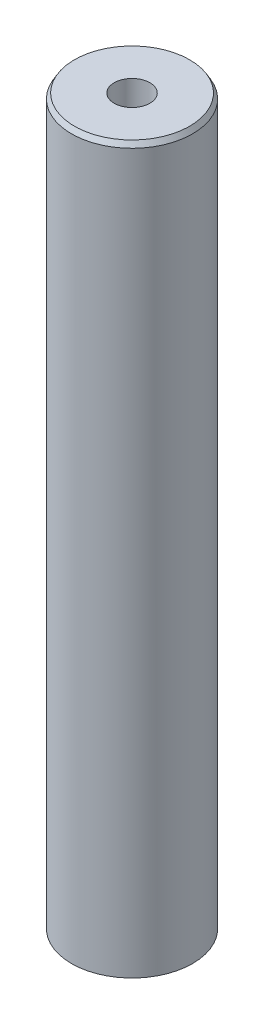
ISO-10303-21;
HEADER;
FILE_DESCRIPTION(('STEP AP214'),'2;1');
FILE_NAME('part.step','',(''),(''),'','','');
FILE_SCHEMA(('AUTOMOTIVE_DESIGN { 1 0 10303 214 1 1 1 1 }'));
ENDSEC;
DATA;
#1=APPLICATION_CONTEXT('core data for automotive mechanical design processes');
#2=APPLICATION_PROTOCOL_DEFINITION('international standard','automotive_design',2000,#1);
#3=PRODUCT_CONTEXT('',#1,'mechanical');
#4=PRODUCT('Part','Part','',(#3));
#5=PRODUCT_RELATED_PRODUCT_CATEGORY('part','',(#4));
#6=PRODUCT_DEFINITION_FORMATION('','',#4);
#7=PRODUCT_DEFINITION_CONTEXT('part definition',#1,'design');
#8=PRODUCT_DEFINITION('design','',#6,#7);
#9=PRODUCT_DEFINITION_SHAPE('','',#8);
#10=(LENGTH_UNIT() NAMED_UNIT(*) SI_UNIT(.MILLI.,.METRE.));
#11=(NAMED_UNIT(*) PLANE_ANGLE_UNIT() SI_UNIT($,.RADIAN.));
#12=(NAMED_UNIT(*) SI_UNIT($,.STERADIAN.) SOLID_ANGLE_UNIT());
#13=UNCERTAINTY_MEASURE_WITH_UNIT(LENGTH_MEASURE(1.E-05),#10,'distance_accuracy_value','');
#14=(GEOMETRIC_REPRESENTATION_CONTEXT(3) GLOBAL_UNCERTAINTY_ASSIGNED_CONTEXT((#13)) GLOBAL_UNIT_ASSIGNED_CONTEXT((#10,
#11,#12)) REPRESENTATION_CONTEXT('',''));
#15=CARTESIAN_POINT('',(0.,0.,0.));
#16=DIRECTION('',(0.,0.,1.));
#17=DIRECTION('',(1.,0.,0.));
#18=AXIS2_PLACEMENT_3D('',#15,#16,#17);
#19=CARTESIAN_POINT('',(0.,600.,0.));
#20=DIRECTION('',(0.,-1.,0.));
#21=DIRECTION('',(0.,0.,-1.));
#22=AXIS2_PLACEMENT_3D('',#19,#20,#21);
#23=CYLINDRICAL_SURFACE('',#22,50.);
#24=CARTESIAN_POINT('',(0.,595.781942175548,0.));
#25=DIRECTION('',(0.,1.,0.));
#26=DIRECTION('',(0.,0.,1.));
#27=AXIS2_PLACEMENT_3D('',#24,#25,#26);
#28=CIRCLE('',#27,50.);
#29=CARTESIAN_POINT('',(0.,595.781942175548,-50.));
#30=VERTEX_POINT('',#29);
#31=EDGE_CURVE('E50',#30,#30,#28,.F.);
#32=ORIENTED_EDGE('',*,*,#31,.T.);
#33=EDGE_LOOP('',(#32));
#34=FACE_BOUND('',#33,.T.);
#35=CARTESIAN_POINT('',(0.,2.43529682040466,0.));
#36=DIRECTION('',(0.,1.,0.));
#37=DIRECTION('',(0.,0.,1.));
#38=AXIS2_PLACEMENT_3D('',#35,#36,#37);
#39=CIRCLE('',#38,50.);
#40=CARTESIAN_POINT('',(0.,2.43529682040466,50.));
#41=VERTEX_POINT('',#40);
#42=EDGE_CURVE('E51',#41,#41,#39,.T.);
#43=ORIENTED_EDGE('',*,*,#42,.T.);
#44=EDGE_LOOP('',(#43));
#45=FACE_BOUND('',#44,.T.);
#46=ADVANCED_FACE('F39',(#34,#45),#23,.T.);
#47=CARTESIAN_POINT('',(0.,600.,0.));
#48=DIRECTION('',(0.,1.,0.));
#49=DIRECTION('',(0.,0.,1.));
#50=AXIS2_PLACEMENT_3D('',#47,#48,#49);
#51=PLANE('',#50);
#52=CARTESIAN_POINT('',(0.,600.,0.));
#53=DIRECTION('',(0.,1.,0.));
#54=DIRECTION('',(0.,0.,1.));
#55=AXIS2_PLACEMENT_3D('',#52,#53,#54);
#56=CIRCLE('',#55,47.5647031795954);
#57=CARTESIAN_POINT('',(0.,600.,-47.5647031795955));
#58=VERTEX_POINT('',#57);
#59=EDGE_CURVE('E54',#58,#58,#56,.T.);
#60=ORIENTED_EDGE('',*,*,#59,.T.);
#61=EDGE_LOOP('',(#60));
#62=FACE_BOUND('',#61,.T.);
#63=CARTESIAN_POINT('',(0.,600.,0.));
#64=DIRECTION('',(0.,1.,0.));
#65=DIRECTION('',(0.,0.,1.));
#66=AXIS2_PLACEMENT_3D('',#63,#64,#65);
#67=CIRCLE('',#66,14.729349144792);
#68=CARTESIAN_POINT('',(0.,600.,14.729349144792));
#69=VERTEX_POINT('',#68);
#70=EDGE_CURVE('E58',#69,#69,#67,.T.);
#71=ORIENTED_EDGE('',*,*,#70,.F.);
#72=EDGE_LOOP('',(#71));
#73=FACE_BOUND('',#72,.T.);
#74=ADVANCED_FACE('F69',(#62,#73),#51,.T.);
#75=CARTESIAN_POINT('',(0.,0.,0.));
#76=DIRECTION('',(0.,1.,0.));
#77=DIRECTION('',(0.,0.,1.));
#78=AXIS2_PLACEMENT_3D('',#75,#76,#77);
#79=PLANE('',#78);
#80=CARTESIAN_POINT('',(0.,0.,0.));
#81=DIRECTION('',(0.,1.,0.));
#82=DIRECTION('',(0.,0.,1.));
#83=AXIS2_PLACEMENT_3D('',#80,#81,#82);
#84=CIRCLE('',#83,45.7819421755482);
#85=CARTESIAN_POINT('',(0.,0.,45.7819421755482));
#86=VERTEX_POINT('',#85);
#87=EDGE_CURVE('E10',#86,#86,#84,.F.);
#88=ORIENTED_EDGE('',*,*,#87,.T.);
#89=EDGE_LOOP('',(#88));
#90=FACE_BOUND('',#89,.T.);
#91=CARTESIAN_POINT('',(0.,0.,0.));
#92=DIRECTION('',(0.,1.,0.));
#93=DIRECTION('',(0.,0.,1.));
#94=AXIS2_PLACEMENT_3D('',#91,#92,#93);
#95=CIRCLE('',#94,14.729349144792);
#96=CARTESIAN_POINT('',(0.,0.,14.729349144792));
#97=VERTEX_POINT('',#96);
#98=EDGE_CURVE('E63',#97,#97,#95,.T.);
#99=ORIENTED_EDGE('',*,*,#98,.T.);
#100=EDGE_LOOP('',(#99));
#101=FACE_BOUND('',#100,.T.);
#102=ADVANCED_FACE('F75',(#90,#101),#79,.F.);
#103=CARTESIAN_POINT('',(0.,600.,0.));
#104=DIRECTION('',(0.,-1.,0.));
#105=DIRECTION('',(0.,0.,-1.));
#106=AXIS2_PLACEMENT_3D('',#103,#104,#105);
#107=CYLINDRICAL_SURFACE('',#106,14.729349144792);
#108=ORIENTED_EDGE('',*,*,#70,.T.);
#109=EDGE_LOOP('',(#108));
#110=FACE_BOUND('',#109,.T.);
#111=ORIENTED_EDGE('',*,*,#98,.F.);
#112=EDGE_LOOP('',(#111));
#113=FACE_BOUND('',#112,.T.);
#114=ADVANCED_FACE('F70',(#110,#113),#107,.F.);
#115=CARTESIAN_POINT('',(0.,600.,0.));
#116=DIRECTION('',(0.,-1.,0.));
#117=DIRECTION('',(0.,0.,-1.));
#118=AXIS2_PLACEMENT_3D('',#115,#116,#117);
#119=CONICAL_SURFACE('',#118,47.5647031795954,0.523598775598302);
#120=CARTESIAN_POINT('',(0.,595.781942175548,-50.));
#121=CARTESIAN_POINT('',(0.,595.825880277886,-49.9746323247875));
#122=CARTESIAN_POINT('',(0.,595.869818380224,-49.9492646495749));
#123=CARTESIAN_POINT('',(0.,595.9576945849,-49.8985292991498));
#124=CARTESIAN_POINT('',(0.,596.001632687238,-49.8731616239373));
#125=CARTESIAN_POINT('',(0.,596.089508891915,-49.8224262735122));
#126=CARTESIAN_POINT('',(0.,596.133446994253,-49.7970585982997));
#127=CARTESIAN_POINT('',(0.,596.221323198929,-49.7463232478746));
#128=CARTESIAN_POINT('',(0.,596.265261301267,-49.720955572662));
#129=CARTESIAN_POINT('',(0.,596.353137505943,-49.6702202222369));
#130=CARTESIAN_POINT('',(0.,596.397075608281,-49.6448525470244));
#131=CARTESIAN_POINT('',(0.,596.484951812957,-49.5941171965993));
#132=CARTESIAN_POINT('',(0.,596.528889915295,-49.5687495213867));
#133=CARTESIAN_POINT('',(0.,596.616766119971,-49.5180141709616));
#134=CARTESIAN_POINT('',(0.,596.660704222309,-49.4926464957491));
#135=CARTESIAN_POINT('',(0.,596.748580426985,-49.441911145324));
#136=CARTESIAN_POINT('',(0.,596.792518529323,-49.4165434701114));
#137=CARTESIAN_POINT('',(0.,596.880394733999,-49.3658081196863));
#138=CARTESIAN_POINT('',(0.,596.924332836337,-49.3404404444738));
#139=CARTESIAN_POINT('',(0.,597.012209041013,-49.2897050940487));
#140=CARTESIAN_POINT('',(0.,597.056147143351,-49.2643374188362));
#141=CARTESIAN_POINT('',(0.,597.144023348028,-49.2136020684111));
#142=CARTESIAN_POINT('',(0.,597.187961450365,-49.1882343931985));
#143=CARTESIAN_POINT('',(0.,597.275837655042,-49.1374990427734));
#144=CARTESIAN_POINT('',(0.,597.31977575738,-49.1121313675609));
#145=CARTESIAN_POINT('',(0.,597.407651962056,-49.0613960171358));
#146=CARTESIAN_POINT('',(0.,597.451590064394,-49.0360283419232));
#147=CARTESIAN_POINT('',(0.,597.53946626907,-48.9852929914981));
#148=CARTESIAN_POINT('',(0.,597.583404371408,-48.9599253162856));
#149=CARTESIAN_POINT('',(0.,597.671280576084,-48.9091899658605));
#150=CARTESIAN_POINT('',(0.,597.715218678422,-48.8838222906479));
#151=CARTESIAN_POINT('',(0.,597.803094883098,-48.8330869402228));
#152=CARTESIAN_POINT('',(0.,597.847032985436,-48.8077192650103));
#153=CARTESIAN_POINT('',(0.,597.934909190112,-48.7569839145852));
#154=CARTESIAN_POINT('',(0.,597.97884729245,-48.7316162393727));
#155=CARTESIAN_POINT('',(0.,598.066723497126,-48.6808808889476));
#156=CARTESIAN_POINT('',(0.,598.110661599464,-48.655513213735));
#157=CARTESIAN_POINT('',(0.,598.19853780414,-48.6047778633099));
#158=CARTESIAN_POINT('',(0.,598.242475906478,-48.5794101880974));
#159=CARTESIAN_POINT('',(0.,598.330352111155,-48.5286748376723));
#160=CARTESIAN_POINT('',(0.,598.374290213492,-48.5033071624597));
#161=CARTESIAN_POINT('',(0.,598.462166418169,-48.4525718120346));
#162=CARTESIAN_POINT('',(0.,598.506104520507,-48.4272041368221));
#163=CARTESIAN_POINT('',(0.,598.593980725183,-48.376468786397));
#164=CARTESIAN_POINT('',(0.,598.637918827521,-48.3511011111844));
#165=CARTESIAN_POINT('',(0.,598.725795032197,-48.3003657607593));
#166=CARTESIAN_POINT('',(0.,598.769733134535,-48.2749980855468));
#167=CARTESIAN_POINT('',(0.,598.857609339211,-48.2242627351217));
#168=CARTESIAN_POINT('',(0.,598.901547441549,-48.1988950599092));
#169=CARTESIAN_POINT('',(0.,598.989423646225,-48.1481597094841));
#170=CARTESIAN_POINT('',(0.,599.033361748563,-48.1227920342715));
#171=CARTESIAN_POINT('',(0.,599.121237953239,-48.0720566838464));
#172=CARTESIAN_POINT('',(0.,599.165176055577,-48.0466890086339));
#173=CARTESIAN_POINT('',(0.,599.253052260253,-47.9959536582088));
#174=CARTESIAN_POINT('',(0.,599.296990362591,-47.9705859829962));
#175=CARTESIAN_POINT('',(0.,599.384866567267,-47.9198506325711));
#176=CARTESIAN_POINT('',(0.,599.428804669605,-47.8944829573586));
#177=CARTESIAN_POINT('',(0.,599.516680874282,-47.8437476069335));
#178=CARTESIAN_POINT('',(0.,599.560618976619,-47.8183799317209));
#179=CARTESIAN_POINT('',(0.,599.648495181296,-47.7676445812958));
#180=CARTESIAN_POINT('',(0.,599.692433283634,-47.7422769060833));
#181=CARTESIAN_POINT('',(0.,599.78030948831,-47.6915415556582));
#182=CARTESIAN_POINT('',(0.,599.824247590648,-47.6661738804457));
#183=CARTESIAN_POINT('',(0.,599.912123795324,-47.6154385300206));
#184=CARTESIAN_POINT('',(0.,599.956061897662,-47.590070854808));
#185=CARTESIAN_POINT('',(0.,600.,-47.5647031795955));
#186=B_SPLINE_CURVE_WITH_KNOTS('',3,(#120,#121,#122,#123,#124,#125,#126,#127,#128,#129,#130,
#131,#132,#133,#134,#135,#136,#137,#138,#139,#140,#141,#142,#143,#144,#145,#146,#147,#148,#149,
#150,#151,#152,#153,#154,#155,#156,#157,#158,#159,#160,#161,#162,#163,#164,#165,#166,#167,#168,
#169,#170,#171,#172,#173,#174,#175,#176,#177,#178,#179,#180,#181,#182,#183,#184,#185),
.UNSPECIFIED.,.F.,.F.,(4,2,2,2,2,2,2,2,2,2,2,2,2,2,2,2,2,2,2,2,2,2,2,2,2,2,2,2,2,2,2,2,4),(0.,
0.152206051275313,0.304412102550623,0.456618153825936,0.608824205101153,0.761030256376462,
0.913236307651775,1.06544235892708,1.2176484102023,1.36985446147761,1.52206051275292,
1.67426656402814,1.82647261530345,1.97867866657876,2.13088471785407,2.28309076912929,
2.4352968204046,2.58750287167991,2.73970892295513,2.89191497423044,3.04412102550575,
3.19632707678106,3.34853312805628,3.50073917933159,3.6529452306069,3.80515128188212,
3.95735733315743,4.10956338443274,4.26176943570805,4.41397548698327,4.56618153825858,
4.71838758953389,4.8705936408092),.UNSPECIFIED.);
#187=EDGE_CURVE('BSEAM81',#30,#58,#186,.T.);
#188=ORIENTED_EDGE('',*,*,#31,.F.);
#189=ORIENTED_EDGE('',*,*,#59,.F.);
#190=ORIENTED_EDGE('',*,*,#187,.T.);
#191=ORIENTED_EDGE('',*,*,#187,.F.);
#192=EDGE_LOOP('',(#188,#190,#189,#191));
#193=FACE_BOUND('',#192,.T.);
#194=ADVANCED_FACE('F81',(#193),#119,.T.);
#195=CARTESIAN_POINT('',(0.,2.43529682040466,0.));
#196=DIRECTION('',(0.,1.,0.));
#197=DIRECTION('',(0.,0.,1.));
#198=AXIS2_PLACEMENT_3D('',#195,#196,#197);
#199=CONICAL_SURFACE('',#198,50.,1.0471975511966);
#200=ORIENTED_EDGE('',*,*,#87,.F.);
#201=EDGE_LOOP('',(#200));
#202=FACE_BOUND('',#201,.T.);
#203=ORIENTED_EDGE('',*,*,#42,.F.);
#204=EDGE_LOOP('',(#203));
#205=FACE_BOUND('',#204,.T.);
#206=ADVANCED_FACE('F45',(#202,#205),#199,.T.);
#207=CLOSED_SHELL('',(#46,#74,#102,#114,#194,#206));
#208=MANIFOLD_SOLID_BREP('B2',#207);
#209=ADVANCED_BREP_SHAPE_REPRESENTATION('',(#18,#208),#14);
#210=SHAPE_DEFINITION_REPRESENTATION(#9,#209);
ENDSEC;
END-ISO-10303-21;
